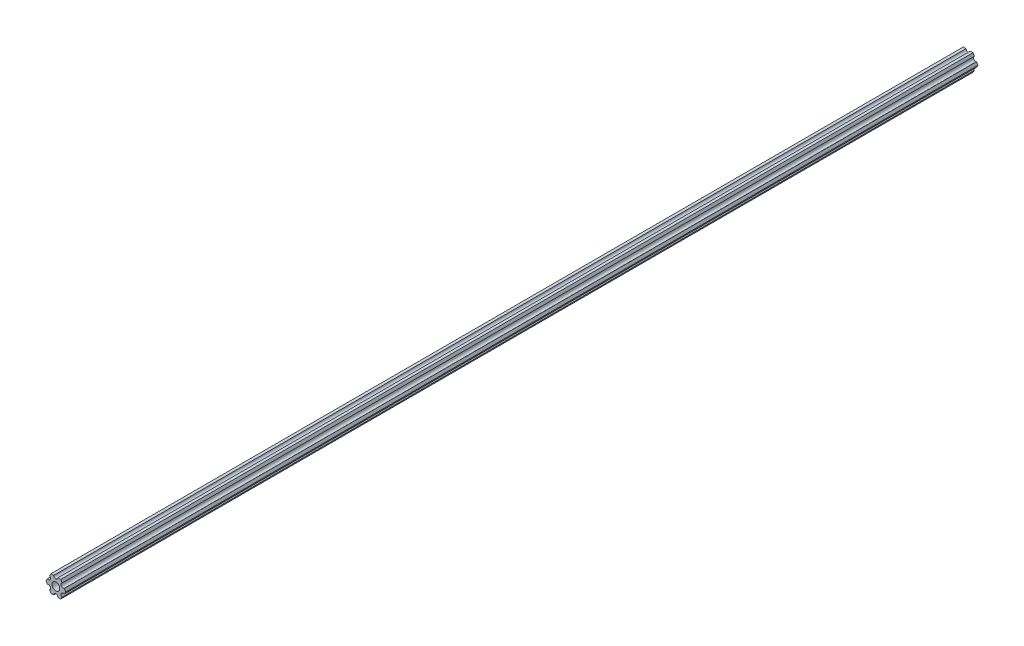
ISO-10303-21;
HEADER;
FILE_DESCRIPTION(('STEP AP214'),'2;1');
FILE_NAME('part.step','',(''),(''),'','','');
FILE_SCHEMA(('AUTOMOTIVE_DESIGN { 1 0 10303 214 1 1 1 1 }'));
ENDSEC;
DATA;
#1=APPLICATION_CONTEXT('core data for automotive mechanical design processes');
#2=APPLICATION_PROTOCOL_DEFINITION('international standard','automotive_design',2000,#1);
#3=PRODUCT_CONTEXT('',#1,'mechanical');
#4=PRODUCT('Part','Part','',(#3));
#5=PRODUCT_RELATED_PRODUCT_CATEGORY('part','',(#4));
#6=PRODUCT_DEFINITION_FORMATION('','',#4);
#7=PRODUCT_DEFINITION_CONTEXT('part definition',#1,'design');
#8=PRODUCT_DEFINITION('design','',#6,#7);
#9=PRODUCT_DEFINITION_SHAPE('','',#8);
#10=(LENGTH_UNIT() NAMED_UNIT(*) SI_UNIT(.MILLI.,.METRE.));
#11=(NAMED_UNIT(*) PLANE_ANGLE_UNIT() SI_UNIT($,.RADIAN.));
#12=(NAMED_UNIT(*) SI_UNIT($,.STERADIAN.) SOLID_ANGLE_UNIT());
#13=UNCERTAINTY_MEASURE_WITH_UNIT(LENGTH_MEASURE(1.E-05),#10,'distance_accuracy_value','');
#14=(GEOMETRIC_REPRESENTATION_CONTEXT(3) GLOBAL_UNCERTAINTY_ASSIGNED_CONTEXT((#13)) GLOBAL_UNIT_ASSIGNED_CONTEXT((#10,
#11,#12)) REPRESENTATION_CONTEXT('',''));
#15=CARTESIAN_POINT('',(0.,0.,0.));
#16=DIRECTION('',(0.,0.,1.));
#17=DIRECTION('',(1.,0.,0.));
#18=AXIS2_PLACEMENT_3D('',#15,#16,#17);
#19=CARTESIAN_POINT('',(-5.49926150638083,-3.17499966684068,-681.0248));
#20=DIRECTION('',(0.,0.,1.));
#21=DIRECTION('',(1.,0.,0.));
#22=AXIS2_PLACEMENT_3D('',#19,#20,#21);
#23=CYLINDRICAL_SURFACE('',#22,1.58750000000001);
#24=CARTESIAN_POINT('',(-5.49926150638083,-3.17499966684068,0.));
#25=DIRECTION('',(0.,0.,-1.));
#26=DIRECTION('',(-1.,0.,0.));
#27=AXIS2_PLACEMENT_3D('',#24,#25,#26);
#28=CIRCLE('',#27,1.58750000000001);
#29=CARTESIAN_POINT('',(-6.29301142309098,-1.80018429024546,0.));
#30=VERTEX_POINT('',#29);
#31=CARTESIAN_POINT('',(-4.70551158967068,-4.54981504343589,0.));
#32=VERTEX_POINT('',#31);
#33=EDGE_CURVE('E206',#30,#32,#28,.T.);
#34=ORIENTED_EDGE('',*,*,#33,.F.);
#35=DIRECTION('',(0.,0.,1.));
#36=VECTOR('',#35,1.);
#37=CARTESIAN_POINT('',(-6.29301142309098,-1.80018429024546,-681.0248));
#38=LINE('',#37,#36);
#39=CARTESIAN_POINT('',(-6.29301142309098,-1.80018429024546,-681.0248));
#40=VERTEX_POINT('',#39);
#41=EDGE_CURVE('E11',#40,#30,#38,.T.);
#42=ORIENTED_EDGE('',*,*,#41,.F.);
#43=CARTESIAN_POINT('',(-5.49926150638083,-3.17499966684068,-681.0248));
#44=DIRECTION('',(0.,0.,-1.));
#45=DIRECTION('',(-1.,0.,0.));
#46=AXIS2_PLACEMENT_3D('',#43,#44,#45);
#47=CIRCLE('',#46,1.58750000000001);
#48=CARTESIAN_POINT('',(-4.70551158967068,-4.54981504343589,-681.0248));
#49=VERTEX_POINT('',#48);
#50=EDGE_CURVE('E266',#40,#49,#47,.T.);
#51=ORIENTED_EDGE('',*,*,#50,.T.);
#52=DIRECTION('',(0.,0.,1.));
#53=VECTOR('',#52,1.);
#54=CARTESIAN_POINT('',(-4.70551158967068,-4.54981504343589,-681.0248));
#55=LINE('',#54,#53);
#56=EDGE_CURVE('E42',#49,#32,#55,.T.);
#57=ORIENTED_EDGE('',*,*,#56,.T.);
#58=EDGE_LOOP('',(#34,#42,#51,#57));
#59=FACE_BOUND('',#58,.T.);
#60=ADVANCED_FACE('F39',(#59),#23,.F.);
#61=CARTESIAN_POINT('',(-7.33234841870826,4.44212518856872E-07,-681.0248));
#62=DIRECTION('',(-0.866025434075723,-0.499999947533953,0.));
#63=DIRECTION('',(0.499999947533953,-0.866025434075723,0.));
#64=AXIS2_PLACEMENT_3D('',#61,#62,#63);
#65=PLANE('',#64);
#66=DIRECTION('',(0.499999947533953,-0.866025434075723,0.));
#67=VECTOR('',#66,1.);
#68=CARTESIAN_POINT('',(-7.33234841870826,4.44212518856872E-07,0.));
#69=LINE('',#68,#67);
#70=CARTESIAN_POINT('',(-7.33234841870826,4.44212518856872E-07,0.));
#71=VERTEX_POINT('',#70);
#72=EDGE_CURVE('E263',#71,#30,#69,.T.);
#73=ORIENTED_EDGE('',*,*,#72,.F.);
#74=DIRECTION('',(0.,0.,1.));
#75=VECTOR('',#74,1.);
#76=CARTESIAN_POINT('',(-7.33234841870826,4.44212518856872E-07,-681.0248));
#77=LINE('',#76,#75);
#78=CARTESIAN_POINT('',(-7.33234841870826,4.44212518856872E-07,-681.0248));
#79=VERTEX_POINT('',#78);
#80=EDGE_CURVE('E49',#79,#71,#77,.T.);
#81=ORIENTED_EDGE('',*,*,#80,.F.);
#82=DIRECTION('',(0.499999947533953,-0.866025434075723,0.));
#83=VECTOR('',#82,1.);
#84=CARTESIAN_POINT('',(-7.33234841870826,4.44212518856872E-07,-681.0248));
#85=LINE('',#84,#83);
#86=EDGE_CURVE('E196',#79,#40,#85,.T.);
#87=ORIENTED_EDGE('',*,*,#86,.T.);
#88=ORIENTED_EDGE('',*,*,#41,.T.);
#89=EDGE_LOOP('',(#73,#81,#87,#88));
#90=FACE_BOUND('',#89,.T.);
#91=ADVANCED_FACE('F314',(#90),#65,.T.);
#92=CARTESIAN_POINT('',(-6.29301120497139,1.80018505273895,-681.0248));
#93=DIRECTION('',(-0.866025373493145,0.500000052466056,0.));
#94=DIRECTION('',(-0.500000052466056,-0.866025373493145,0.));
#95=AXIS2_PLACEMENT_3D('',#92,#93,#94);
#96=PLANE('',#95);
#97=DIRECTION('',(-0.500000052466056,-0.866025373493145,0.));
#98=VECTOR('',#97,1.);
#99=CARTESIAN_POINT('',(-6.29301120497139,1.80018505273895,0.));
#100=LINE('',#99,#98);
#101=CARTESIAN_POINT('',(-6.29301120497139,1.80018505273895,0.));
#102=VERTEX_POINT('',#101);
#103=EDGE_CURVE('E182',#102,#71,#100,.T.);
#104=ORIENTED_EDGE('',*,*,#103,.F.);
#105=DIRECTION('',(0.,0.,1.));
#106=VECTOR('',#105,1.);
#107=CARTESIAN_POINT('',(-6.29301120497139,1.80018505273895,-681.0248));
#108=LINE('',#107,#106);
#109=CARTESIAN_POINT('',(-6.29301120497139,1.80018505273895,-681.0248));
#110=VERTEX_POINT('',#109);
#111=EDGE_CURVE('E177',#110,#102,#108,.T.);
#112=ORIENTED_EDGE('',*,*,#111,.F.);
#113=DIRECTION('',(-0.500000052466056,-0.866025373493145,0.));
#114=VECTOR('',#113,1.);
#115=CARTESIAN_POINT('',(-6.29301120497139,1.80018505273895,-681.0248));
#116=LINE('',#115,#114);
#117=EDGE_CURVE('E180',#110,#79,#116,.T.);
#118=ORIENTED_EDGE('',*,*,#117,.T.);
#119=ORIENTED_EDGE('',*,*,#80,.T.);
#120=EDGE_LOOP('',(#104,#112,#118,#119));
#121=FACE_BOUND('',#120,.T.);
#122=ADVANCED_FACE('F179',(#121),#96,.T.);
#123=CARTESIAN_POINT('',(-5.49926112168152,3.17500033315931,-681.0248));
#124=DIRECTION('',(0.,0.,1.));
#125=DIRECTION('',(1.,0.,0.));
#126=AXIS2_PLACEMENT_3D('',#123,#124,#125);
#127=CYLINDRICAL_SURFACE('',#126,1.5875);
#128=CARTESIAN_POINT('',(-5.49926112168152,3.17500033315931,0.));
#129=DIRECTION('',(0.,0.,-1.));
#130=DIRECTION('',(-1.,0.,0.));
#131=AXIS2_PLACEMENT_3D('',#128,#129,#130);
#132=CIRCLE('',#131,1.5875);
#133=CARTESIAN_POINT('',(-4.70551103839166,4.54981561357968,0.));
#134=VERTEX_POINT('',#133);
#135=EDGE_CURVE('E258',#134,#102,#132,.T.);
#136=ORIENTED_EDGE('',*,*,#135,.F.);
#137=DIRECTION('',(0.,0.,1.));
#138=VECTOR('',#137,1.);
#139=CARTESIAN_POINT('',(-4.70551103839166,4.54981561357968,-681.0248));
#140=LINE('',#139,#138);
#141=CARTESIAN_POINT('',(-4.70551103839166,4.54981561357968,-681.0248));
#142=VERTEX_POINT('',#141);
#143=EDGE_CURVE('E188',#142,#134,#140,.T.);
#144=ORIENTED_EDGE('',*,*,#143,.F.);
#145=CARTESIAN_POINT('',(-5.49926112168152,3.17500033315931,-681.0248));
#146=DIRECTION('',(0.,0.,-1.));
#147=DIRECTION('',(-1.,0.,0.));
#148=AXIS2_PLACEMENT_3D('',#145,#146,#147);
#149=CIRCLE('',#148,1.5875);
#150=EDGE_CURVE('E194',#142,#110,#149,.T.);
#151=ORIENTED_EDGE('',*,*,#150,.T.);
#152=ORIENTED_EDGE('',*,*,#111,.T.);
#153=EDGE_LOOP('',(#136,#144,#151,#152));
#154=FACE_BOUND('',#153,.T.);
#155=ADVANCED_FACE('F198',(#154),#127,.F.);
#156=CARTESIAN_POINT('',(-3.66617382465472,6.35000022210622,-681.0248));
#157=DIRECTION('',(-0.866025373493145,0.500000052466056,0.));
#158=DIRECTION('',(-0.500000052466056,-0.866025373493145,0.));
#159=AXIS2_PLACEMENT_3D('',#156,#157,#158);
#160=PLANE('',#159);
#161=DIRECTION('',(-0.500000052466056,-0.866025373493145,0.));
#162=VECTOR('',#161,1.);
#163=CARTESIAN_POINT('',(-3.66617382465472,6.35000022210622,0.));
#164=LINE('',#163,#162);
#165=CARTESIAN_POINT('',(-3.66617382465472,6.35000022210622,0.));
#166=VERTEX_POINT('',#165);
#167=EDGE_CURVE('E254',#166,#134,#164,.T.);
#168=ORIENTED_EDGE('',*,*,#167,.F.);
#169=DIRECTION('',(0.,0.,1.));
#170=VECTOR('',#169,1.);
#171=CARTESIAN_POINT('',(-3.66617382465472,6.35000022210622,-681.0248));
#172=LINE('',#171,#170);
#173=CARTESIAN_POINT('',(-3.66617382465472,6.35000022210622,-681.0248));
#174=VERTEX_POINT('',#173);
#175=EDGE_CURVE('E272',#174,#166,#172,.T.);
#176=ORIENTED_EDGE('',*,*,#175,.F.);
#177=DIRECTION('',(-0.500000052466056,-0.866025373493145,0.));
#178=VECTOR('',#177,1.);
#179=CARTESIAN_POINT('',(-3.66617382465472,6.35000022210622,-681.0248));
#180=LINE('',#179,#178);
#181=EDGE_CURVE('E199',#174,#142,#180,.T.);
#182=ORIENTED_EDGE('',*,*,#181,.T.);
#183=ORIENTED_EDGE('',*,*,#143,.T.);
#184=EDGE_LOOP('',(#168,#176,#182,#183));
#185=FACE_BOUND('',#184,.T.);
#186=ADVANCED_FACE('F327',(#185),#160,.T.);
#187=CARTESIAN_POINT('',(-1.58749884590197,6.35000022210623,-681.0248));
#188=DIRECTION('',(0.,1.,0.));
#189=DIRECTION('',(-1.,0.,0.));
#190=AXIS2_PLACEMENT_3D('',#187,#188,#189);
#191=PLANE('',#190);
#192=DIRECTION('',(-1.,0.,0.));
#193=VECTOR('',#192,1.);
#194=CARTESIAN_POINT('',(-1.58749884590197,6.35000022210623,0.));
#195=LINE('',#194,#193);
#196=CARTESIAN_POINT('',(-1.58749884590197,6.35000022210623,0.));
#197=VERTEX_POINT('',#196);
#198=EDGE_CURVE('E250',#197,#166,#195,.T.);
#199=ORIENTED_EDGE('',*,*,#198,.F.);
#200=DIRECTION('',(0.,0.,1.));
#201=VECTOR('',#200,1.);
#202=CARTESIAN_POINT('',(-1.58749884590197,6.35000022210623,-681.0248));
#203=LINE('',#202,#201);
#204=CARTESIAN_POINT('',(-1.58749884590197,6.35000022210623,-681.0248));
#205=VERTEX_POINT('',#204);
#206=EDGE_CURVE('E275',#205,#197,#203,.T.);
#207=ORIENTED_EDGE('',*,*,#206,.F.);
#208=DIRECTION('',(-1.,0.,0.));
#209=VECTOR('',#208,1.);
#210=CARTESIAN_POINT('',(-1.58749884590197,6.35000022210623,-681.0248));
#211=LINE('',#210,#209);
#212=EDGE_CURVE('E201',#205,#174,#211,.T.);
#213=ORIENTED_EDGE('',*,*,#212,.T.);
#214=ORIENTED_EDGE('',*,*,#175,.T.);
#215=EDGE_LOOP('',(#199,#207,#213,#214));
#216=FACE_BOUND('',#215,.T.);
#217=ADVANCED_FACE('F330',(#216),#191,.T.);
#218=CARTESIAN_POINT('',(3.84699344941095E-07,6.35000022210623,-681.0248));
#219=DIRECTION('',(0.,0.,1.));
#220=DIRECTION('',(1.,0.,0.));
#221=AXIS2_PLACEMENT_3D('',#218,#219,#220);
#222=CYLINDRICAL_SURFACE('',#221,1.58749884590197);
#223=CARTESIAN_POINT('',(3.84699344941095E-07,6.35000022210623,0.));
#224=DIRECTION('',(0.,0.,-1.));
#225=DIRECTION('',(-1.,0.,0.));
#226=AXIS2_PLACEMENT_3D('',#223,#224,#225);
#227=CIRCLE('',#226,1.58749884590197);
#228=CARTESIAN_POINT('',(1.58749923060131,6.35000022210623,0.));
#229=VERTEX_POINT('',#228);
#230=EDGE_CURVE('E246',#229,#197,#227,.T.);
#231=ORIENTED_EDGE('',*,*,#230,.F.);
#232=DIRECTION('',(0.,0.,1.));
#233=VECTOR('',#232,1.);
#234=CARTESIAN_POINT('',(1.58749923060131,6.35000022210623,-681.0248));
#235=LINE('',#234,#233);
#236=CARTESIAN_POINT('',(1.58749923060131,6.35000022210623,-681.0248));
#237=VERTEX_POINT('',#236);
#238=EDGE_CURVE('E278',#237,#229,#235,.T.);
#239=ORIENTED_EDGE('',*,*,#238,.F.);
#240=CARTESIAN_POINT('',(3.84699344941095E-07,6.35000022210623,-681.0248));
#241=DIRECTION('',(0.,0.,-1.));
#242=DIRECTION('',(-1.,0.,0.));
#243=AXIS2_PLACEMENT_3D('',#240,#241,#242);
#244=CIRCLE('',#243,1.58749884590197);
#245=EDGE_CURVE('E436',#237,#205,#244,.T.);
#246=ORIENTED_EDGE('',*,*,#245,.T.);
#247=ORIENTED_EDGE('',*,*,#206,.T.);
#248=EDGE_LOOP('',(#231,#239,#246,#247));
#249=FACE_BOUND('',#248,.T.);
#250=ADVANCED_FACE('F334',(#249),#222,.F.);
#251=CARTESIAN_POINT('',(3.66617452134701,6.35000022210623,-681.0248));
#252=DIRECTION('',(0.,1.,0.));
#253=DIRECTION('',(-1.,0.,0.));
#254=AXIS2_PLACEMENT_3D('',#251,#252,#253);
#255=PLANE('',#254);
#256=DIRECTION('',(-1.,0.,0.));
#257=VECTOR('',#256,1.);
#258=CARTESIAN_POINT('',(3.66617452134701,6.35000022210623,0.));
#259=LINE('',#258,#257);
#260=CARTESIAN_POINT('',(3.66617452134701,6.35000022210623,0.));
#261=VERTEX_POINT('',#260);
#262=EDGE_CURVE('E242',#261,#229,#259,.T.);
#263=ORIENTED_EDGE('',*,*,#262,.F.);
#264=DIRECTION('',(0.,0.,1.));
#265=VECTOR('',#264,1.);
#266=CARTESIAN_POINT('',(3.66617452134701,6.35000022210623,-681.0248));
#267=LINE('',#266,#265);
#268=CARTESIAN_POINT('',(3.66617452134701,6.35000022210623,-681.0248));
#269=VERTEX_POINT('',#268);
#270=EDGE_CURVE('E281',#269,#261,#267,.T.);
#271=ORIENTED_EDGE('',*,*,#270,.F.);
#272=DIRECTION('',(-1.,0.,0.));
#273=VECTOR('',#272,1.);
#274=CARTESIAN_POINT('',(3.66617452134701,6.35000022210623,-681.0248));
#275=LINE('',#274,#273);
#276=EDGE_CURVE('E433',#269,#237,#275,.T.);
#277=ORIENTED_EDGE('',*,*,#276,.T.);
#278=ORIENTED_EDGE('',*,*,#238,.T.);
#279=EDGE_LOOP('',(#263,#271,#277,#278));
#280=FACE_BOUND('',#279,.T.);
#281=ADVANCED_FACE('F338',(#280),#255,.T.);
#282=CARTESIAN_POINT('',(4.70551142760333,4.54981551649452,-681.0248));
#283=DIRECTION('',(0.866025449221368,0.499999921300922,0.));
#284=DIRECTION('',(-0.499999921300922,0.866025449221368,0.));
#285=AXIS2_PLACEMENT_3D('',#282,#283,#284);
#286=PLANE('',#285);
#287=DIRECTION('',(-0.499999921300922,0.866025449221368,0.));
#288=VECTOR('',#287,1.);
#289=CARTESIAN_POINT('',(4.70551142760333,4.54981551649452,0.));
#290=LINE('',#289,#288);
#291=CARTESIAN_POINT('',(4.70551142760333,4.54981551649452,0.));
#292=VERTEX_POINT('',#291);
#293=EDGE_CURVE('E238',#292,#261,#290,.T.);
#294=ORIENTED_EDGE('',*,*,#293,.F.);
#295=DIRECTION('',(0.,0.,1.));
#296=VECTOR('',#295,1.);
#297=CARTESIAN_POINT('',(4.70551142760333,4.54981551649452,-681.0248));
#298=LINE('',#297,#296);
#299=CARTESIAN_POINT('',(4.70551142760333,4.54981551649452,-681.0248));
#300=VERTEX_POINT('',#299);
#301=EDGE_CURVE('E284',#300,#292,#298,.T.);
#302=ORIENTED_EDGE('',*,*,#301,.F.);
#303=DIRECTION('',(-0.499999921300922,0.866025449221368,0.));
#304=VECTOR('',#303,1.);
#305=CARTESIAN_POINT('',(4.70551142760333,4.54981551649452,-681.0248));
#306=LINE('',#305,#304);
#307=EDGE_CURVE('E430',#300,#269,#306,.T.);
#308=ORIENTED_EDGE('',*,*,#307,.T.);
#309=ORIENTED_EDGE('',*,*,#270,.T.);
#310=EDGE_LOOP('',(#294,#302,#308,#309));
#311=FACE_BOUND('',#310,.T.);
#312=ADVANCED_FACE('F342',(#311),#286,.T.);
#313=CARTESIAN_POINT('',(5.49926130266854,3.1750001158556,-681.0248));
#314=DIRECTION('',(0.,0.,1.));
#315=DIRECTION('',(1.,0.,0.));
#316=AXIS2_PLACEMENT_3D('',#313,#314,#315);
#317=CYLINDRICAL_SURFACE('',#316,1.5875);
#318=CARTESIAN_POINT('',(5.49926130266854,3.1750001158556,0.));
#319=DIRECTION('',(0.,0.,-1.));
#320=DIRECTION('',(-1.,0.,0.));
#321=AXIS2_PLACEMENT_3D('',#318,#319,#320);
#322=CIRCLE('',#321,1.5875);
#323=CARTESIAN_POINT('',(6.29301117773375,1.80018471521667,0.));
#324=VERTEX_POINT('',#323);
#325=EDGE_CURVE('E234',#324,#292,#322,.T.);
#326=ORIENTED_EDGE('',*,*,#325,.F.);
#327=DIRECTION('',(0.,0.,1.));
#328=VECTOR('',#327,1.);
#329=CARTESIAN_POINT('',(6.29301117773375,1.80018471521667,-681.0248));
#330=LINE('',#329,#328);
#331=CARTESIAN_POINT('',(6.29301117773375,1.80018471521667,-681.0248));
#332=VERTEX_POINT('',#331);
#333=EDGE_CURVE('E287',#332,#324,#330,.T.);
#334=ORIENTED_EDGE('',*,*,#333,.F.);
#335=CARTESIAN_POINT('',(5.49926130266854,3.1750001158556,-681.0248));
#336=DIRECTION('',(0.,0.,-1.));
#337=DIRECTION('',(-1.,0.,0.));
#338=AXIS2_PLACEMENT_3D('',#335,#336,#337);
#339=CIRCLE('',#338,1.5875);
#340=EDGE_CURVE('E427',#332,#300,#339,.T.);
#341=ORIENTED_EDGE('',*,*,#340,.T.);
#342=ORIENTED_EDGE('',*,*,#301,.T.);
#343=EDGE_LOOP('',(#326,#334,#341,#342));
#344=FACE_BOUND('',#343,.T.);
#345=ADVANCED_FACE('F346',(#344),#317,.F.);
#346=CARTESIAN_POINT('',(7.33234803400895,9.61748368946088E-08,-681.0248));
#347=DIRECTION('',(0.866025449221368,0.499999921300922,0.));
#348=DIRECTION('',(-0.499999921300922,0.866025449221368,0.));
#349=AXIS2_PLACEMENT_3D('',#346,#347,#348);
#350=PLANE('',#349);
#351=DIRECTION('',(-0.499999921300922,0.866025449221368,0.));
#352=VECTOR('',#351,1.);
#353=CARTESIAN_POINT('',(7.33234803400895,9.61748368946088E-08,0.));
#354=LINE('',#353,#352);
#355=CARTESIAN_POINT('',(7.33234803400895,9.61748368946088E-08,0.));
#356=VERTEX_POINT('',#355);
#357=EDGE_CURVE('E231',#356,#324,#354,.T.);
#358=ORIENTED_EDGE('',*,*,#357,.F.);
#359=DIRECTION('',(0.,0.,1.));
#360=VECTOR('',#359,1.);
#361=CARTESIAN_POINT('',(7.33234803400895,9.61748368946088E-08,-681.0248));
#362=LINE('',#361,#360);
#363=CARTESIAN_POINT('',(7.33234803400895,9.61748368946088E-08,-681.0248));
#364=VERTEX_POINT('',#363);
#365=EDGE_CURVE('E290',#364,#356,#362,.T.);
#366=ORIENTED_EDGE('',*,*,#365,.F.);
#367=DIRECTION('',(-0.499999921300922,0.866025449221368,0.));
#368=VECTOR('',#367,1.);
#369=CARTESIAN_POINT('',(7.33234803400895,9.61748368946088E-08,-681.0248));
#370=LINE('',#369,#368);
#371=EDGE_CURVE('E424',#364,#332,#370,.T.);
#372=ORIENTED_EDGE('',*,*,#371,.T.);
#373=ORIENTED_EDGE('',*,*,#333,.T.);
#374=EDGE_LOOP('',(#358,#366,#372,#373));
#375=FACE_BOUND('',#374,.T.);
#376=ADVANCED_FACE('F350',(#375),#350,.T.);
#377=CARTESIAN_POINT('',(6.29301092933191,-1.80018457531732,-681.0248));
#378=DIRECTION('',(0.866025403784438,-0.5,0.));
#379=DIRECTION('',(0.5,0.866025403784439,0.));
#380=AXIS2_PLACEMENT_3D('',#377,#378,#379);
#381=PLANE('',#380);
#382=DIRECTION('',(0.5,0.866025403784438,0.));
#383=VECTOR('',#382,1.);
#384=CARTESIAN_POINT('',(6.29301092933191,-1.80018457531732,0.));
#385=LINE('',#384,#383);
#386=CARTESIAN_POINT('',(6.29301092933191,-1.80018457531732,0.));
#387=VERTEX_POINT('',#386);
#388=EDGE_CURVE('E228',#387,#356,#385,.T.);
#389=ORIENTED_EDGE('',*,*,#388,.F.);
#390=DIRECTION('',(0.,0.,1.));
#391=VECTOR('',#390,1.);
#392=CARTESIAN_POINT('',(6.29301092933191,-1.80018457531732,-681.0248));
#393=LINE('',#392,#391);
#394=CARTESIAN_POINT('',(6.29301092933191,-1.80018457531732,-681.0248));
#395=VERTEX_POINT('',#394);
#396=EDGE_CURVE('E293',#395,#387,#393,.T.);
#397=ORIENTED_EDGE('',*,*,#396,.F.);
#398=DIRECTION('',(0.5,0.866025403784438,0.));
#399=VECTOR('',#398,1.);
#400=CARTESIAN_POINT('',(6.29301092933191,-1.80018457531732,-681.0248));
#401=LINE('',#400,#399);
#402=EDGE_CURVE('E421',#395,#364,#401,.T.);
#403=ORIENTED_EDGE('',*,*,#402,.T.);
#404=ORIENTED_EDGE('',*,*,#365,.T.);
#405=EDGE_LOOP('',(#389,#397,#403,#404));
#406=FACE_BOUND('',#405,.T.);
#407=ADVANCED_FACE('F354',(#406),#381,.T.);
#408=CARTESIAN_POINT('',(5.49926092933191,-3.17499990382512,-681.0248));
#409=DIRECTION('',(0.,0.,1.));
#410=DIRECTION('',(1.,0.,0.));
#411=AXIS2_PLACEMENT_3D('',#408,#409,#410);
#412=CYLINDRICAL_SURFACE('',#411,1.5875);
#413=CARTESIAN_POINT('',(5.49926092933191,-3.17499990382512,0.));
#414=DIRECTION('',(0.,0.,-1.));
#415=DIRECTION('',(-1.,0.,0.));
#416=AXIS2_PLACEMENT_3D('',#413,#414,#415);
#417=CIRCLE('',#416,1.5875);
#418=CARTESIAN_POINT('',(4.70551092933191,-4.54981523233291,0.));
#419=VERTEX_POINT('',#418);
#420=EDGE_CURVE('E225',#419,#387,#417,.T.);
#421=ORIENTED_EDGE('',*,*,#420,.F.);
#422=DIRECTION('',(0.,0.,1.));
#423=VECTOR('',#422,1.);
#424=CARTESIAN_POINT('',(4.70551092933191,-4.54981523233291,-681.0248));
#425=LINE('',#424,#423);
#426=CARTESIAN_POINT('',(4.70551092933191,-4.54981523233291,-681.0248));
#427=VERTEX_POINT('',#426);
#428=EDGE_CURVE('E296',#427,#419,#425,.T.);
#429=ORIENTED_EDGE('',*,*,#428,.F.);
#430=CARTESIAN_POINT('',(5.49926092933191,-3.17499990382512,-681.0248));
#431=DIRECTION('',(0.,0.,-1.));
#432=DIRECTION('',(-1.,0.,0.));
#433=AXIS2_PLACEMENT_3D('',#430,#431,#432);
#434=CIRCLE('',#433,1.5875);
#435=EDGE_CURVE('E418',#427,#395,#434,.T.);
#436=ORIENTED_EDGE('',*,*,#435,.T.);
#437=ORIENTED_EDGE('',*,*,#396,.T.);
#438=EDGE_LOOP('',(#421,#429,#436,#437));
#439=FACE_BOUND('',#438,.T.);
#440=ADVANCED_FACE('F358',(#439),#412,.F.);
#441=CARTESIAN_POINT('',(3.66617382465481,-6.34999990382519,-681.0248));
#442=DIRECTION('',(0.866025403784438,-0.5,0.));
#443=DIRECTION('',(0.5,0.866025403784439,0.));
#444=AXIS2_PLACEMENT_3D('',#441,#442,#443);
#445=PLANE('',#444);
#446=DIRECTION('',(0.5,0.866025403784439,0.));
#447=VECTOR('',#446,1.);
#448=CARTESIAN_POINT('',(3.66617382465481,-6.34999990382519,0.));
#449=LINE('',#448,#447);
#450=CARTESIAN_POINT('',(3.66617382465481,-6.34999990382519,0.));
#451=VERTEX_POINT('',#450);
#452=EDGE_CURVE('E222',#451,#419,#449,.T.);
#453=ORIENTED_EDGE('',*,*,#452,.F.);
#454=DIRECTION('',(0.,0.,1.));
#455=VECTOR('',#454,1.);
#456=CARTESIAN_POINT('',(3.66617382465481,-6.34999990382519,-681.0248));
#457=LINE('',#456,#455);
#458=CARTESIAN_POINT('',(3.66617382465481,-6.34999990382519,-681.0248));
#459=VERTEX_POINT('',#458);
#460=EDGE_CURVE('E299',#459,#451,#457,.T.);
#461=ORIENTED_EDGE('',*,*,#460,.F.);
#462=DIRECTION('',(0.5,0.866025403784439,0.));
#463=VECTOR('',#462,1.);
#464=CARTESIAN_POINT('',(3.66617382465481,-6.34999990382519,-681.0248));
#465=LINE('',#464,#463);
#466=EDGE_CURVE('E415',#459,#427,#465,.T.);
#467=ORIENTED_EDGE('',*,*,#466,.T.);
#468=ORIENTED_EDGE('',*,*,#428,.T.);
#469=EDGE_LOOP('',(#453,#461,#467,#468));
#470=FACE_BOUND('',#469,.T.);
#471=ADVANCED_FACE('F362',(#470),#445,.T.);
#472=CARTESIAN_POINT('',(1.58750115409778,-6.34999990382519,-681.0248));
#473=DIRECTION('',(0.,-1.,0.));
#474=DIRECTION('',(1.,0.,0.));
#475=AXIS2_PLACEMENT_3D('',#472,#473,#474);
#476=PLANE('',#475);
#477=DIRECTION('',(1.,0.,0.));
#478=VECTOR('',#477,1.);
#479=CARTESIAN_POINT('',(1.58750115409778,-6.34999990382519,0.));
#480=LINE('',#479,#478);
#481=CARTESIAN_POINT('',(1.58750115409778,-6.34999990382519,0.));
#482=VERTEX_POINT('',#481);
#483=EDGE_CURVE('E219',#482,#451,#480,.T.);
#484=ORIENTED_EDGE('',*,*,#483,.F.);
#485=DIRECTION('',(0.,0.,1.));
#486=VECTOR('',#485,1.);
#487=CARTESIAN_POINT('',(1.58750115409778,-6.34999990382519,-681.0248));
#488=LINE('',#487,#486);
#489=CARTESIAN_POINT('',(1.58750115409778,-6.34999990382519,-681.0248));
#490=VERTEX_POINT('',#489);
#491=EDGE_CURVE('E302',#490,#482,#488,.T.);
#492=ORIENTED_EDGE('',*,*,#491,.F.);
#493=DIRECTION('',(1.,0.,0.));
#494=VECTOR('',#493,1.);
#495=CARTESIAN_POINT('',(1.58750115409778,-6.34999990382519,-681.0248));
#496=LINE('',#495,#494);
#497=EDGE_CURVE('E412',#490,#459,#496,.T.);
#498=ORIENTED_EDGE('',*,*,#497,.T.);
#499=ORIENTED_EDGE('',*,*,#460,.T.);
#500=EDGE_LOOP('',(#484,#492,#498,#499));
#501=FACE_BOUND('',#500,.T.);
#502=ADVANCED_FACE('F366',(#501),#476,.T.);
#503=CARTESIAN_POINT('',(-3.8469926204343E-07,-6.34999990382519,-681.0248));
#504=DIRECTION('',(0.,0.,1.));
#505=DIRECTION('',(1.,0.,0.));
#506=AXIS2_PLACEMENT_3D('',#503,#504,#505);
#507=CYLINDRICAL_SURFACE('',#506,1.58750115409778);
#508=CARTESIAN_POINT('',(-3.8469926204343E-07,-6.34999990382519,0.));
#509=DIRECTION('',(0.,0.,-1.));
#510=DIRECTION('',(-1.,0.,0.));
#511=AXIS2_PLACEMENT_3D('',#508,#509,#510);
#512=CIRCLE('',#511,1.58750115409778);
#513=CARTESIAN_POINT('',(-1.58750153879705,-6.34999990382519,0.));
#514=VERTEX_POINT('',#513);
#515=EDGE_CURVE('E216',#514,#482,#512,.T.);
#516=ORIENTED_EDGE('',*,*,#515,.F.);
#517=DIRECTION('',(0.,0.,1.));
#518=VECTOR('',#517,1.);
#519=CARTESIAN_POINT('',(-1.58750153879705,-6.34999990382519,-681.0248));
#520=LINE('',#519,#518);
#521=CARTESIAN_POINT('',(-1.58750153879705,-6.34999990382519,-681.0248));
#522=VERTEX_POINT('',#521);
#523=EDGE_CURVE('E305',#522,#514,#520,.T.);
#524=ORIENTED_EDGE('',*,*,#523,.F.);
#525=CARTESIAN_POINT('',(-3.8469926204343E-07,-6.34999990382519,-681.0248));
#526=DIRECTION('',(0.,0.,-1.));
#527=DIRECTION('',(-1.,0.,0.));
#528=AXIS2_PLACEMENT_3D('',#525,#526,#527);
#529=CIRCLE('',#528,1.58750115409778);
#530=EDGE_CURVE('E409',#522,#490,#529,.T.);
#531=ORIENTED_EDGE('',*,*,#530,.T.);
#532=ORIENTED_EDGE('',*,*,#491,.T.);
#533=EDGE_LOOP('',(#516,#524,#531,#532));
#534=FACE_BOUND('',#533,.T.);
#535=ADVANCED_FACE('F370',(#534),#507,.F.);
#536=CARTESIAN_POINT('',(-3.66617452134693,-6.34999990382519,-681.0248));
#537=DIRECTION('',(0.,-1.,0.));
#538=DIRECTION('',(1.,0.,0.));
#539=AXIS2_PLACEMENT_3D('',#536,#537,#538);
#540=PLANE('',#539);
#541=DIRECTION('',(1.,0.,0.));
#542=VECTOR('',#541,1.);
#543=CARTESIAN_POINT('',(-3.66617452134693,-6.34999990382519,0.));
#544=LINE('',#543,#542);
#545=CARTESIAN_POINT('',(-3.66617452134693,-6.34999990382519,0.));
#546=VERTEX_POINT('',#545);
#547=EDGE_CURVE('E213',#546,#514,#544,.T.);
#548=ORIENTED_EDGE('',*,*,#547,.F.);
#549=DIRECTION('',(0.,0.,1.));
#550=VECTOR('',#549,1.);
#551=CARTESIAN_POINT('',(-3.66617452134693,-6.34999990382519,-681.0248));
#552=LINE('',#551,#550);
#553=CARTESIAN_POINT('',(-3.66617452134693,-6.34999990382519,-681.0248));
#554=VERTEX_POINT('',#553);
#555=EDGE_CURVE('E307',#554,#546,#552,.T.);
#556=ORIENTED_EDGE('',*,*,#555,.F.);
#557=DIRECTION('',(1.,0.,0.));
#558=VECTOR('',#557,1.);
#559=CARTESIAN_POINT('',(-3.66617452134693,-6.34999990382519,-681.0248));
#560=LINE('',#559,#558);
#561=EDGE_CURVE('E406',#554,#522,#560,.T.);
#562=ORIENTED_EDGE('',*,*,#561,.T.);
#563=ORIENTED_EDGE('',*,*,#523,.T.);
#564=EDGE_LOOP('',(#548,#556,#562,#563));
#565=FACE_BOUND('',#564,.T.);
#566=ADVANCED_FACE('F374',(#565),#540,.T.);
#567=CARTESIAN_POINT('',(-4.70551158967068,-4.54981504343589,-681.0248));
#568=DIRECTION('',(-0.866025434075723,-0.499999947533953,0.));
#569=DIRECTION('',(0.499999947533953,-0.866025434075723,0.));
#570=AXIS2_PLACEMENT_3D('',#567,#568,#569);
#571=PLANE('',#570);
#572=DIRECTION('',(0.499999947533953,-0.866025434075723,0.));
#573=VECTOR('',#572,1.);
#574=CARTESIAN_POINT('',(-4.70551158967068,-4.54981504343589,0.));
#575=LINE('',#574,#573);
#576=EDGE_CURVE('E209',#32,#546,#575,.T.);
#577=ORIENTED_EDGE('',*,*,#576,.F.);
#578=ORIENTED_EDGE('',*,*,#56,.F.);
#579=DIRECTION('',(0.499999947533953,-0.866025434075723,0.));
#580=VECTOR('',#579,1.);
#581=CARTESIAN_POINT('',(-4.70551158967068,-4.54981504343589,-681.0248));
#582=LINE('',#581,#580);
#583=EDGE_CURVE('E404',#49,#554,#582,.T.);
#584=ORIENTED_EDGE('',*,*,#583,.T.);
#585=ORIENTED_EDGE('',*,*,#555,.T.);
#586=EDGE_LOOP('',(#577,#578,#584,#585));
#587=FACE_BOUND('',#586,.T.);
#588=ADVANCED_FACE('F311',(#587),#571,.T.);
#589=CARTESIAN_POINT('',(-5.49926150638083,-3.17499966684068,-681.0248));
#590=DIRECTION('',(0.,0.,-1.));
#591=DIRECTION('',(-1.,0.,0.));
#592=AXIS2_PLACEMENT_3D('',#589,#590,#591);
#593=PLANE('',#592);
#594=CARTESIAN_POINT('',(0.,0.,-681.0248));
#595=DIRECTION('',(0.,0.,1.));
#596=DIRECTION('',(-1.,0.,0.));
#597=AXIS2_PLACEMENT_3D('',#594,#595,#596);
#598=CIRCLE('',#597,2.9337);
#599=CARTESIAN_POINT('',(-2.9337,0.,-681.0248));
#600=VERTEX_POINT('',#599);
#601=EDGE_CURVE('E210',#600,#600,#598,.T.);
#602=ORIENTED_EDGE('',*,*,#601,.T.);
#603=EDGE_LOOP('',(#602));
#604=FACE_BOUND('',#603,.T.);
#605=ORIENTED_EDGE('',*,*,#50,.F.);
#606=ORIENTED_EDGE('',*,*,#86,.F.);
#607=ORIENTED_EDGE('',*,*,#117,.F.);
#608=ORIENTED_EDGE('',*,*,#150,.F.);
#609=ORIENTED_EDGE('',*,*,#181,.F.);
#610=ORIENTED_EDGE('',*,*,#212,.F.);
#611=ORIENTED_EDGE('',*,*,#245,.F.);
#612=ORIENTED_EDGE('',*,*,#276,.F.);
#613=ORIENTED_EDGE('',*,*,#307,.F.);
#614=ORIENTED_EDGE('',*,*,#340,.F.);
#615=ORIENTED_EDGE('',*,*,#371,.F.);
#616=ORIENTED_EDGE('',*,*,#402,.F.);
#617=ORIENTED_EDGE('',*,*,#435,.F.);
#618=ORIENTED_EDGE('',*,*,#466,.F.);
#619=ORIENTED_EDGE('',*,*,#497,.F.);
#620=ORIENTED_EDGE('',*,*,#530,.F.);
#621=ORIENTED_EDGE('',*,*,#561,.F.);
#622=ORIENTED_EDGE('',*,*,#583,.F.);
#623=EDGE_LOOP('',(#605,#606,#607,#608,#609,#610,#611,#612,#613,#614,#615,#616,#617,#618,#619,
#620,#621,#622));
#624=FACE_BOUND('',#623,.T.);
#625=ADVANCED_FACE('F192',(#604,#624),#593,.T.);
#626=CARTESIAN_POINT('',(-5.49926150638083,-3.17499966684068,0.));
#627=DIRECTION('',(0.,0.,-1.));
#628=DIRECTION('',(-1.,0.,0.));
#629=AXIS2_PLACEMENT_3D('',#626,#627,#628);
#630=PLANE('',#629);
#631=CARTESIAN_POINT('',(0.,0.,0.));
#632=DIRECTION('',(0.,0.,1.));
#633=DIRECTION('',(-1.,0.,0.));
#634=AXIS2_PLACEMENT_3D('',#631,#632,#633);
#635=CIRCLE('',#634,2.9337);
#636=CARTESIAN_POINT('',(-2.9337,0.,0.));
#637=VERTEX_POINT('',#636);
#638=EDGE_CURVE('E398',#637,#637,#635,.T.);
#639=ORIENTED_EDGE('',*,*,#638,.F.);
#640=EDGE_LOOP('',(#639));
#641=FACE_BOUND('',#640,.T.);
#642=ORIENTED_EDGE('',*,*,#33,.T.);
#643=ORIENTED_EDGE('',*,*,#576,.T.);
#644=ORIENTED_EDGE('',*,*,#547,.T.);
#645=ORIENTED_EDGE('',*,*,#515,.T.);
#646=ORIENTED_EDGE('',*,*,#483,.T.);
#647=ORIENTED_EDGE('',*,*,#452,.T.);
#648=ORIENTED_EDGE('',*,*,#420,.T.);
#649=ORIENTED_EDGE('',*,*,#388,.T.);
#650=ORIENTED_EDGE('',*,*,#357,.T.);
#651=ORIENTED_EDGE('',*,*,#325,.T.);
#652=ORIENTED_EDGE('',*,*,#293,.T.);
#653=ORIENTED_EDGE('',*,*,#262,.T.);
#654=ORIENTED_EDGE('',*,*,#230,.T.);
#655=ORIENTED_EDGE('',*,*,#198,.T.);
#656=ORIENTED_EDGE('',*,*,#167,.T.);
#657=ORIENTED_EDGE('',*,*,#135,.T.);
#658=ORIENTED_EDGE('',*,*,#103,.T.);
#659=ORIENTED_EDGE('',*,*,#72,.T.);
#660=EDGE_LOOP('',(#642,#643,#644,#645,#646,#647,#648,#649,#650,#651,#652,#653,#654,#655,#656,
#657,#658,#659));
#661=FACE_BOUND('',#660,.T.);
#662=ADVANCED_FACE('F313',(#641,#661),#630,.F.);
#663=CARTESIAN_POINT('',(0.,0.,-681.0248));
#664=DIRECTION('',(0.,0.,1.));
#665=DIRECTION('',(1.,0.,0.));
#666=AXIS2_PLACEMENT_3D('',#663,#664,#665);
#667=CYLINDRICAL_SURFACE('',#666,2.9337);
#668=ORIENTED_EDGE('',*,*,#601,.F.);
#669=EDGE_LOOP('',(#668));
#670=FACE_BOUND('',#669,.T.);
#671=ORIENTED_EDGE('',*,*,#638,.T.);
#672=EDGE_LOOP('',(#671));
#673=FACE_BOUND('',#672,.T.);
#674=ADVANCED_FACE('F386',(#670,#673),#667,.F.);
#675=CLOSED_SHELL('',(#60,#91,#122,#155,#186,#217,#250,#281,#312,#345,#376,#407,#440,#471,#502,
#535,#566,#588,#625,#662,#674));
#676=MANIFOLD_SOLID_BREP('B2',#675);
#677=ADVANCED_BREP_SHAPE_REPRESENTATION('',(#18,#676),#14);
#678=SHAPE_DEFINITION_REPRESENTATION(#9,#677);
ENDSEC;
END-ISO-10303-21;
